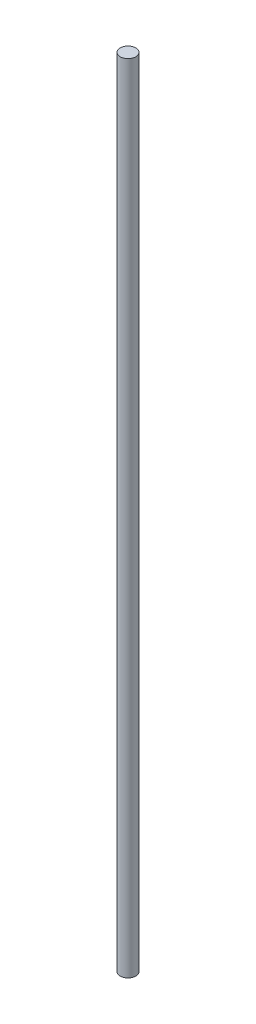
ISO-10303-21;
HEADER;
FILE_DESCRIPTION(('STEP AP214'),'2;1');
FILE_NAME('part.step','',(''),(''),'','','');
FILE_SCHEMA(('AUTOMOTIVE_DESIGN { 1 0 10303 214 1 1 1 1 }'));
ENDSEC;
DATA;
#1=APPLICATION_CONTEXT('core data for automotive mechanical design processes');
#2=APPLICATION_PROTOCOL_DEFINITION('international standard','automotive_design',2000,#1);
#3=PRODUCT_CONTEXT('',#1,'mechanical');
#4=PRODUCT('Part','Part','',(#3));
#5=PRODUCT_RELATED_PRODUCT_CATEGORY('part','',(#4));
#6=PRODUCT_DEFINITION_FORMATION('','',#4);
#7=PRODUCT_DEFINITION_CONTEXT('part definition',#1,'design');
#8=PRODUCT_DEFINITION('design','',#6,#7);
#9=PRODUCT_DEFINITION_SHAPE('','',#8);
#10=(LENGTH_UNIT() NAMED_UNIT(*) SI_UNIT(.MILLI.,.METRE.));
#11=(NAMED_UNIT(*) PLANE_ANGLE_UNIT() SI_UNIT($,.RADIAN.));
#12=(NAMED_UNIT(*) SI_UNIT($,.STERADIAN.) SOLID_ANGLE_UNIT());
#13=UNCERTAINTY_MEASURE_WITH_UNIT(LENGTH_MEASURE(1.E-05),#10,'distance_accuracy_value','');
#14=(GEOMETRIC_REPRESENTATION_CONTEXT(3) GLOBAL_UNCERTAINTY_ASSIGNED_CONTEXT((#13)) GLOBAL_UNIT_ASSIGNED_CONTEXT((#10,
#11,#12)) REPRESENTATION_CONTEXT('',''));
#15=CARTESIAN_POINT('',(0.,0.,0.));
#16=DIRECTION('',(0.,0.,1.));
#17=DIRECTION('',(1.,0.,0.));
#18=AXIS2_PLACEMENT_3D('',#15,#16,#17);
#19=CARTESIAN_POINT('',(0.,90.,0.));
#20=DIRECTION('',(0.,-1.,0.));
#21=DIRECTION('',(0.,0.,-1.));
#22=AXIS2_PLACEMENT_3D('',#19,#20,#21);
#23=CYLINDRICAL_SURFACE('',#22,0.875);
#24=CARTESIAN_POINT('',(0.,90.,0.));
#25=DIRECTION('',(0.,1.,0.));
#26=DIRECTION('',(0.,0.,1.));
#27=AXIS2_PLACEMENT_3D('',#24,#25,#26);
#28=CIRCLE('',#27,0.875);
#29=CARTESIAN_POINT('',(0.,90.,0.875));
#30=VERTEX_POINT('',#29);
#31=EDGE_CURVE('E10',#30,#30,#28,.T.);
#32=ORIENTED_EDGE('',*,*,#31,.F.);
#33=EDGE_LOOP('',(#32));
#34=FACE_BOUND('',#33,.T.);
#35=CARTESIAN_POINT('',(0.,0.,0.));
#36=DIRECTION('',(0.,1.,0.));
#37=DIRECTION('',(0.,0.,1.));
#38=AXIS2_PLACEMENT_3D('',#35,#36,#37);
#39=CIRCLE('',#38,0.875);
#40=CARTESIAN_POINT('',(0.,0.,0.875));
#41=VERTEX_POINT('',#40);
#42=EDGE_CURVE('E34',#41,#41,#39,.T.);
#43=ORIENTED_EDGE('',*,*,#42,.T.);
#44=EDGE_LOOP('',(#43));
#45=FACE_BOUND('',#44,.T.);
#46=ADVANCED_FACE('F31',(#34,#45),#23,.T.);
#47=CARTESIAN_POINT('',(0.,90.,0.));
#48=DIRECTION('',(0.,1.,0.));
#49=DIRECTION('',(0.,0.,1.));
#50=AXIS2_PLACEMENT_3D('',#47,#48,#49);
#51=PLANE('',#50);
#52=ORIENTED_EDGE('',*,*,#31,.T.);
#53=EDGE_LOOP('',(#52));
#54=FACE_BOUND('',#53,.T.);
#55=ADVANCED_FACE('F46',(#54),#51,.T.);
#56=CARTESIAN_POINT('',(0.,0.,0.));
#57=DIRECTION('',(0.,1.,0.));
#58=DIRECTION('',(0.,0.,1.));
#59=AXIS2_PLACEMENT_3D('',#56,#57,#58);
#60=PLANE('',#59);
#61=ORIENTED_EDGE('',*,*,#42,.F.);
#62=EDGE_LOOP('',(#61));
#63=FACE_BOUND('',#62,.T.);
#64=ADVANCED_FACE('F44',(#63),#60,.F.);
#65=CLOSED_SHELL('',(#46,#55,#64));
#66=MANIFOLD_SOLID_BREP('B2',#65);
#67=ADVANCED_BREP_SHAPE_REPRESENTATION('',(#18,#66),#14);
#68=SHAPE_DEFINITION_REPRESENTATION(#9,#67);
ENDSEC;
END-ISO-10303-21;
